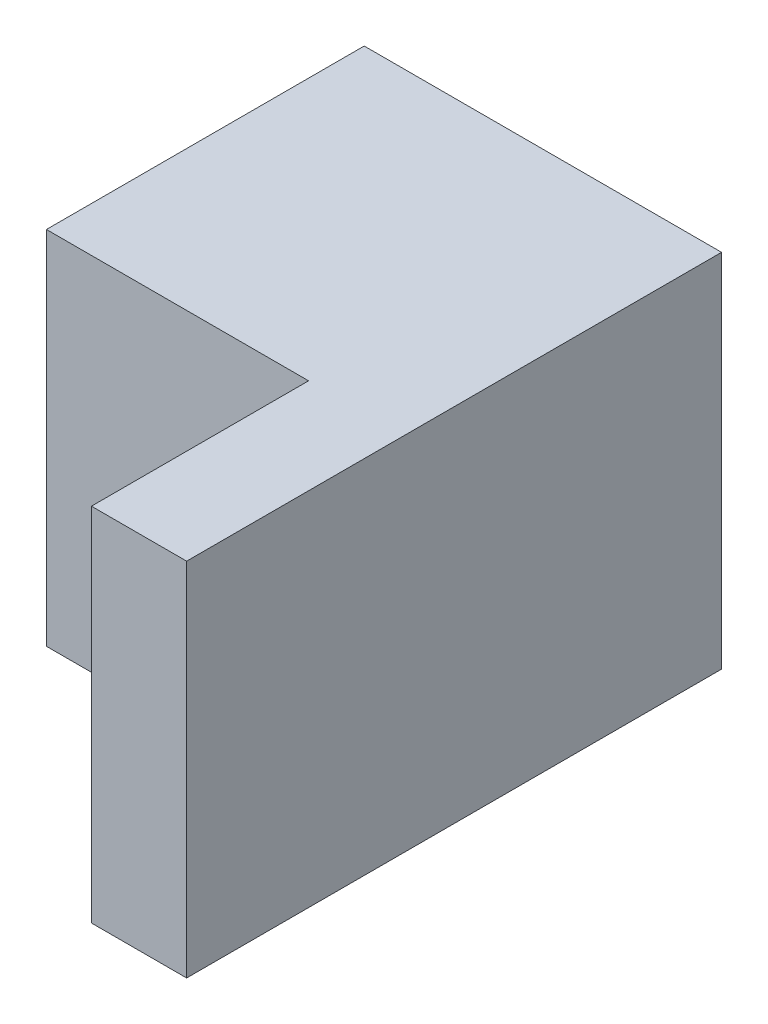
ISO-10303-21;
HEADER;
FILE_DESCRIPTION(('STEP AP214'),'2;1');
FILE_NAME('part.step','',(''),(''),'','','');
FILE_SCHEMA(('AUTOMOTIVE_DESIGN { 1 0 10303 214 1 1 1 1 }'));
ENDSEC;
DATA;
#1=APPLICATION_CONTEXT('core data for automotive mechanical design processes');
#2=APPLICATION_PROTOCOL_DEFINITION('international standard','automotive_design',2000,#1);
#3=PRODUCT_CONTEXT('',#1,'mechanical');
#4=PRODUCT('Part','Part','',(#3));
#5=PRODUCT_RELATED_PRODUCT_CATEGORY('part','',(#4));
#6=PRODUCT_DEFINITION_FORMATION('','',#4);
#7=PRODUCT_DEFINITION_CONTEXT('part definition',#1,'design');
#8=PRODUCT_DEFINITION('design','',#6,#7);
#9=PRODUCT_DEFINITION_SHAPE('','',#8);
#10=(LENGTH_UNIT() NAMED_UNIT(*) SI_UNIT(.MILLI.,.METRE.));
#11=(NAMED_UNIT(*) PLANE_ANGLE_UNIT() SI_UNIT($,.RADIAN.));
#12=(NAMED_UNIT(*) SI_UNIT($,.STERADIAN.) SOLID_ANGLE_UNIT());
#13=UNCERTAINTY_MEASURE_WITH_UNIT(LENGTH_MEASURE(1.E-05),#10,'distance_accuracy_value','');
#14=(GEOMETRIC_REPRESENTATION_CONTEXT(3) GLOBAL_UNCERTAINTY_ASSIGNED_CONTEXT((#13)) GLOBAL_UNIT_ASSIGNED_CONTEXT((#10,
#11,#12)) REPRESENTATION_CONTEXT('',''));
#15=CARTESIAN_POINT('',(0.,0.,0.));
#16=DIRECTION('',(0.,0.,1.));
#17=DIRECTION('',(1.,0.,0.));
#18=AXIS2_PLACEMENT_3D('',#15,#16,#17);
#19=CARTESIAN_POINT('',(0.,0.,60.));
#20=DIRECTION('',(0.,0.,-1.));
#21=DIRECTION('',(-1.,0.,0.));
#22=AXIS2_PLACEMENT_3D('',#19,#20,#21);
#23=PLANE('',#22);
#24=DIRECTION('',(0.,-1.,0.));
#25=VECTOR('',#24,1.);
#26=CARTESIAN_POINT('',(15.7595863524307,34.0815497808049,60.));
#27=LINE('',#26,#25);
#28=CARTESIAN_POINT('',(15.7595863524307,34.0815497808049,60.));
#29=VERTEX_POINT('',#28);
#30=CARTESIAN_POINT('',(15.7595863524307,-34.0815497808049,60.));
#31=VERTEX_POINT('',#30);
#32=EDGE_CURVE('E50',#29,#31,#27,.T.);
#33=ORIENTED_EDGE('',*,*,#32,.F.);
#34=DIRECTION('',(-1.,0.,0.));
#35=VECTOR('',#34,1.);
#36=CARTESIAN_POINT('',(-33.7349577491357,34.0815497808049,60.));
#37=LINE('',#36,#35);
#38=CARTESIAN_POINT('',(-33.7349577491357,34.0815497808049,60.));
#39=VERTEX_POINT('',#38);
#40=EDGE_CURVE('E88',#29,#39,#37,.T.);
#41=ORIENTED_EDGE('',*,*,#40,.T.);
#42=DIRECTION('',(0.,-1.,0.));
#43=VECTOR('',#42,1.);
#44=CARTESIAN_POINT('',(-33.7349577491357,-34.0815497808049,60.));
#45=LINE('',#44,#43);
#46=CARTESIAN_POINT('',(-33.7349577491357,-34.0815497808049,60.));
#47=VERTEX_POINT('',#46);
#48=EDGE_CURVE('E56',#39,#47,#45,.T.);
#49=ORIENTED_EDGE('',*,*,#48,.T.);
#50=DIRECTION('',(1.,0.,0.));
#51=VECTOR('',#50,1.);
#52=CARTESIAN_POINT('',(-33.7349577491357,-34.0815497808049,60.));
#53=LINE('',#52,#51);
#54=EDGE_CURVE('E98',#47,#31,#53,.T.);
#55=ORIENTED_EDGE('',*,*,#54,.T.);
#56=EDGE_LOOP('',(#33,#41,#49,#55));
#57=FACE_BOUND('',#56,.T.);
#58=ADVANCED_FACE('F33',(#57),#23,.F.);
#59=CARTESIAN_POINT('',(33.7349577491357,-34.0815497808049,60.));
#60=DIRECTION('',(-1.,0.,0.));
#61=DIRECTION('',(0.,0.,1.));
#62=AXIS2_PLACEMENT_3D('',#59,#60,#61);
#63=PLANE('',#62);
#64=DIRECTION('',(0.,1.,0.));
#65=VECTOR('',#64,1.);
#66=CARTESIAN_POINT('',(33.7349577491357,-34.0815497808049,0.));
#67=LINE('',#66,#65);
#68=CARTESIAN_POINT('',(33.7349577491357,-34.0815497808049,0.));
#69=VERTEX_POINT('',#68);
#70=CARTESIAN_POINT('',(33.7349577491357,34.0815497808049,0.));
#71=VERTEX_POINT('',#70);
#72=EDGE_CURVE('E95',#69,#71,#67,.T.);
#73=ORIENTED_EDGE('',*,*,#72,.T.);
#74=DIRECTION('',(0.,0.,-1.));
#75=VECTOR('',#74,1.);
#76=CARTESIAN_POINT('',(33.7349577491357,34.0815497808049,60.));
#77=LINE('',#76,#75);
#78=CARTESIAN_POINT('',(33.7349577491357,34.0815497808049,101.));
#79=VERTEX_POINT('',#78);
#80=EDGE_CURVE('E11',#79,#71,#77,.T.);
#81=ORIENTED_EDGE('',*,*,#80,.F.);
#82=DIRECTION('',(0.,1.,0.));
#83=VECTOR('',#82,1.);
#84=CARTESIAN_POINT('',(33.7349577491357,34.0815497808049,101.));
#85=LINE('',#84,#83);
#86=CARTESIAN_POINT('',(33.7349577491357,-34.0815497808049,101.));
#87=VERTEX_POINT('',#86);
#88=EDGE_CURVE('E97',#87,#79,#85,.T.);
#89=ORIENTED_EDGE('',*,*,#88,.F.);
#90=DIRECTION('',(0.,0.,-1.));
#91=VECTOR('',#90,1.);
#92=CARTESIAN_POINT('',(33.7349577491357,-34.0815497808049,60.));
#93=LINE('',#92,#91);
#94=EDGE_CURVE('E81',#87,#69,#93,.T.);
#95=ORIENTED_EDGE('',*,*,#94,.T.);
#96=EDGE_LOOP('',(#73,#81,#89,#95));
#97=FACE_BOUND('',#96,.T.);
#98=ADVANCED_FACE('F35',(#97),#63,.F.);
#99=CARTESIAN_POINT('',(-33.7349577491357,34.0815497808049,60.));
#100=DIRECTION('',(0.,-1.,0.));
#101=DIRECTION('',(0.,0.,-1.));
#102=AXIS2_PLACEMENT_3D('',#99,#100,#101);
#103=PLANE('',#102);
#104=DIRECTION('',(-1.,0.,0.));
#105=VECTOR('',#104,1.);
#106=CARTESIAN_POINT('',(-33.7349577491357,34.0815497808049,0.));
#107=LINE('',#106,#105);
#108=CARTESIAN_POINT('',(-33.7349577491357,34.0815497808049,0.));
#109=VERTEX_POINT('',#108);
#110=EDGE_CURVE('E101',#71,#109,#107,.T.);
#111=ORIENTED_EDGE('',*,*,#110,.T.);
#112=DIRECTION('',(0.,0.,-1.));
#113=VECTOR('',#112,1.);
#114=CARTESIAN_POINT('',(-33.7349577491357,34.0815497808049,60.));
#115=LINE('',#114,#113);
#116=EDGE_CURVE('E42',#39,#109,#115,.T.);
#117=ORIENTED_EDGE('',*,*,#116,.F.);
#118=ORIENTED_EDGE('',*,*,#40,.F.);
#119=DIRECTION('',(0.,0.,-1.));
#120=VECTOR('',#119,1.);
#121=CARTESIAN_POINT('',(15.7595863524307,34.0815497808049,101.));
#122=LINE('',#121,#120);
#123=CARTESIAN_POINT('',(15.7595863524307,34.0815497808049,101.));
#124=VERTEX_POINT('',#123);
#125=EDGE_CURVE('E106',#124,#29,#122,.T.);
#126=ORIENTED_EDGE('',*,*,#125,.F.);
#127=DIRECTION('',(-1.,0.,0.));
#128=VECTOR('',#127,1.);
#129=CARTESIAN_POINT('',(15.7595863524307,34.0815497808049,101.));
#130=LINE('',#129,#128);
#131=EDGE_CURVE('E137',#79,#124,#130,.T.);
#132=ORIENTED_EDGE('',*,*,#131,.F.);
#133=ORIENTED_EDGE('',*,*,#80,.T.);
#134=EDGE_LOOP('',(#111,#117,#118,#126,#132,#133));
#135=FACE_BOUND('',#134,.T.);
#136=ADVANCED_FACE('F150',(#135),#103,.F.);
#137=CARTESIAN_POINT('',(-33.7349577491357,-34.0815497808049,60.));
#138=DIRECTION('',(1.,0.,0.));
#139=DIRECTION('',(0.,0.,-1.));
#140=AXIS2_PLACEMENT_3D('',#137,#138,#139);
#141=PLANE('',#140);
#142=DIRECTION('',(0.,-1.,0.));
#143=VECTOR('',#142,1.);
#144=CARTESIAN_POINT('',(-33.7349577491357,-34.0815497808049,0.));
#145=LINE('',#144,#143);
#146=CARTESIAN_POINT('',(-33.7349577491357,-34.0815497808049,0.));
#147=VERTEX_POINT('',#146);
#148=EDGE_CURVE('E89',#109,#147,#145,.T.);
#149=ORIENTED_EDGE('',*,*,#148,.T.);
#150=DIRECTION('',(0.,0.,-1.));
#151=VECTOR('',#150,1.);
#152=CARTESIAN_POINT('',(-33.7349577491357,-34.0815497808049,60.));
#153=LINE('',#152,#151);
#154=EDGE_CURVE('E84',#47,#147,#153,.T.);
#155=ORIENTED_EDGE('',*,*,#154,.F.);
#156=ORIENTED_EDGE('',*,*,#48,.F.);
#157=ORIENTED_EDGE('',*,*,#116,.T.);
#158=EDGE_LOOP('',(#149,#155,#156,#157));
#159=FACE_BOUND('',#158,.T.);
#160=ADVANCED_FACE('F153',(#159),#141,.F.);
#161=CARTESIAN_POINT('',(-33.7349577491357,-34.0815497808049,60.));
#162=DIRECTION('',(0.,1.,0.));
#163=DIRECTION('',(0.,0.,1.));
#164=AXIS2_PLACEMENT_3D('',#161,#162,#163);
#165=PLANE('',#164);
#166=DIRECTION('',(1.,0.,0.));
#167=VECTOR('',#166,1.);
#168=CARTESIAN_POINT('',(-33.7349577491357,-34.0815497808049,0.));
#169=LINE('',#168,#167);
#170=EDGE_CURVE('E76',#147,#69,#169,.T.);
#171=ORIENTED_EDGE('',*,*,#170,.T.);
#172=ORIENTED_EDGE('',*,*,#94,.F.);
#173=DIRECTION('',(1.,0.,0.));
#174=VECTOR('',#173,1.);
#175=CARTESIAN_POINT('',(15.7595863524307,-34.0815497808049,101.));
#176=LINE('',#175,#174);
#177=CARTESIAN_POINT('',(15.7595863524307,-34.0815497808049,101.));
#178=VERTEX_POINT('',#177);
#179=EDGE_CURVE('E125',#178,#87,#176,.T.);
#180=ORIENTED_EDGE('',*,*,#179,.F.);
#181=DIRECTION('',(0.,0.,-1.));
#182=VECTOR('',#181,1.);
#183=CARTESIAN_POINT('',(15.7595863524307,-34.0815497808049,101.));
#184=LINE('',#183,#182);
#185=EDGE_CURVE('E102',#178,#31,#184,.T.);
#186=ORIENTED_EDGE('',*,*,#185,.T.);
#187=ORIENTED_EDGE('',*,*,#54,.F.);
#188=ORIENTED_EDGE('',*,*,#154,.T.);
#189=EDGE_LOOP('',(#171,#172,#180,#186,#187,#188));
#190=FACE_BOUND('',#189,.T.);
#191=ADVANCED_FACE('F78',(#190),#165,.F.);
#192=CARTESIAN_POINT('',(0.,0.,0.));
#193=DIRECTION('',(0.,0.,-1.));
#194=DIRECTION('',(-1.,0.,0.));
#195=AXIS2_PLACEMENT_3D('',#192,#193,#194);
#196=PLANE('',#195);
#197=ORIENTED_EDGE('',*,*,#72,.F.);
#198=ORIENTED_EDGE('',*,*,#170,.F.);
#199=ORIENTED_EDGE('',*,*,#148,.F.);
#200=ORIENTED_EDGE('',*,*,#110,.F.);
#201=EDGE_LOOP('',(#197,#198,#199,#200));
#202=FACE_BOUND('',#201,.T.);
#203=ADVANCED_FACE('F100',(#202),#196,.T.);
#204=CARTESIAN_POINT('',(15.7595863524307,34.0815497808049,101.));
#205=DIRECTION('',(1.,0.,0.));
#206=DIRECTION('',(0.,0.,-1.));
#207=AXIS2_PLACEMENT_3D('',#204,#205,#206);
#208=PLANE('',#207);
#209=ORIENTED_EDGE('',*,*,#32,.T.);
#210=ORIENTED_EDGE('',*,*,#185,.F.);
#211=DIRECTION('',(0.,-1.,0.));
#212=VECTOR('',#211,1.);
#213=CARTESIAN_POINT('',(15.7595863524307,34.0815497808049,101.));
#214=LINE('',#213,#212);
#215=EDGE_CURVE('E132',#124,#178,#214,.T.);
#216=ORIENTED_EDGE('',*,*,#215,.F.);
#217=ORIENTED_EDGE('',*,*,#125,.T.);
#218=EDGE_LOOP('',(#209,#210,#216,#217));
#219=FACE_BOUND('',#218,.T.);
#220=ADVANCED_FACE('F130',(#219),#208,.F.);
#221=CARTESIAN_POINT('',(0.,0.,101.));
#222=DIRECTION('',(0.,0.,1.));
#223=DIRECTION('',(1.,0.,0.));
#224=AXIS2_PLACEMENT_3D('',#221,#222,#223);
#225=PLANE('',#224);
#226=ORIENTED_EDGE('',*,*,#215,.T.);
#227=ORIENTED_EDGE('',*,*,#179,.T.);
#228=ORIENTED_EDGE('',*,*,#88,.T.);
#229=ORIENTED_EDGE('',*,*,#131,.T.);
#230=EDGE_LOOP('',(#226,#227,#228,#229));
#231=FACE_BOUND('',#230,.T.);
#232=ADVANCED_FACE('F143',(#231),#225,.T.);
#233=CLOSED_SHELL('',(#58,#98,#136,#160,#191,#203,#220,#232));
#234=MANIFOLD_SOLID_BREP('B2',#233);
#235=ADVANCED_BREP_SHAPE_REPRESENTATION('',(#18,#234),#14);
#236=SHAPE_DEFINITION_REPRESENTATION(#9,#235);
ENDSEC;
END-ISO-10303-21;
